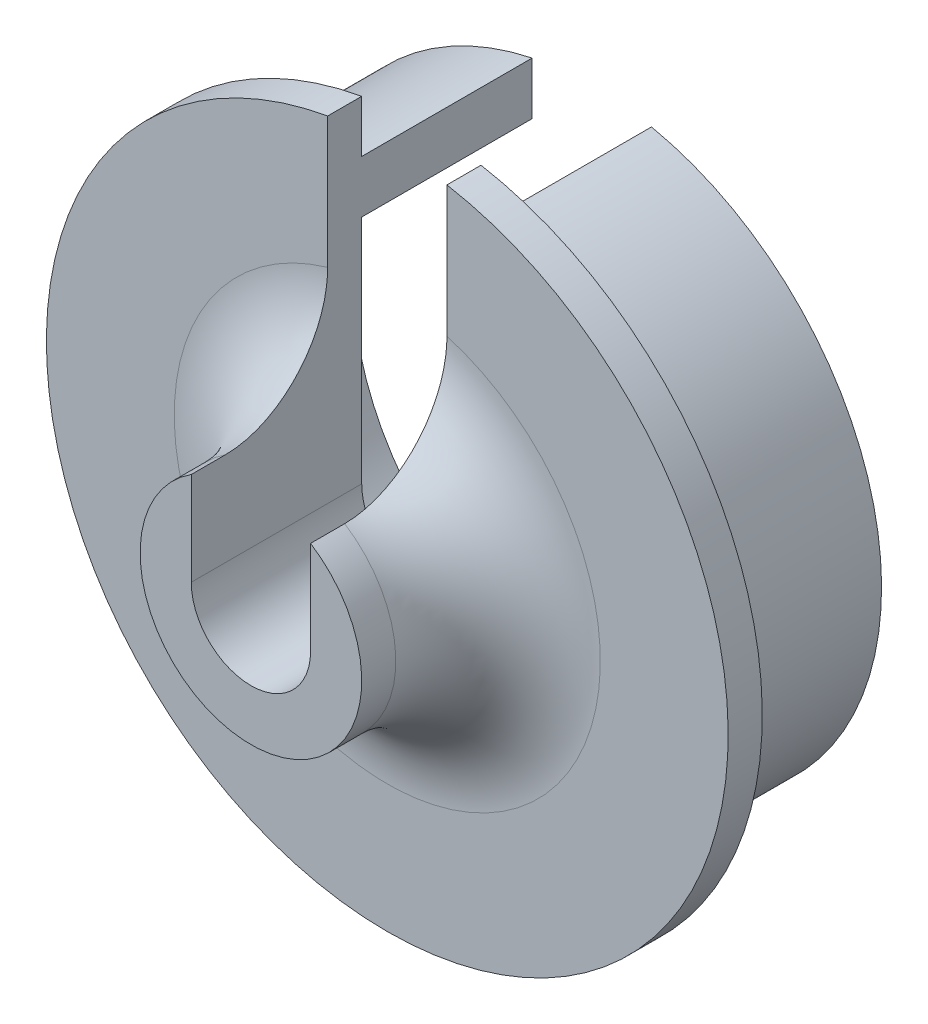
ISO-10303-21;
HEADER;
FILE_DESCRIPTION(('STEP AP214'),'2;1');
FILE_NAME('part.step','',(''),(''),'','','');
FILE_SCHEMA(('AUTOMOTIVE_DESIGN { 1 0 10303 214 1 1 1 1 }'));
ENDSEC;
DATA;
#1=APPLICATION_CONTEXT('core data for automotive mechanical design processes');
#2=APPLICATION_PROTOCOL_DEFINITION('international standard','automotive_design',2000,#1);
#3=PRODUCT_CONTEXT('',#1,'mechanical');
#4=PRODUCT('Part','Part','',(#3));
#5=PRODUCT_RELATED_PRODUCT_CATEGORY('part','',(#4));
#6=PRODUCT_DEFINITION_FORMATION('','',#4);
#7=PRODUCT_DEFINITION_CONTEXT('part definition',#1,'design');
#8=PRODUCT_DEFINITION('design','',#6,#7);
#9=PRODUCT_DEFINITION_SHAPE('','',#8);
#10=(LENGTH_UNIT() NAMED_UNIT(*) SI_UNIT(.MILLI.,.METRE.));
#11=(NAMED_UNIT(*) PLANE_ANGLE_UNIT() SI_UNIT($,.RADIAN.));
#12=(NAMED_UNIT(*) SI_UNIT($,.STERADIAN.) SOLID_ANGLE_UNIT());
#13=UNCERTAINTY_MEASURE_WITH_UNIT(LENGTH_MEASURE(1.E-05),#10,'distance_accuracy_value','');
#14=(GEOMETRIC_REPRESENTATION_CONTEXT(3) GLOBAL_UNCERTAINTY_ASSIGNED_CONTEXT((#13)) GLOBAL_UNIT_ASSIGNED_CONTEXT((#10,
#11,#12)) REPRESENTATION_CONTEXT('',''));
#15=CARTESIAN_POINT('',(0.,0.,0.));
#16=DIRECTION('',(0.,0.,1.));
#17=DIRECTION('',(1.,0.,0.));
#18=AXIS2_PLACEMENT_3D('',#15,#16,#17);
#19=CARTESIAN_POINT('',(0.,0.,0.));
#20=DIRECTION('',(0.,0.,1.));
#21=DIRECTION('',(1.,0.,0.));
#22=AXIS2_PLACEMENT_3D('',#19,#20,#21);
#23=CYLINDRICAL_SURFACE('',#22,1.75);
#24=DIRECTION('',(0.,0.,-1.));
#25=VECTOR('',#24,1.);
#26=CARTESIAN_POINT('',(-1.75,0.,0.));
#27=LINE('',#26,#25);
#28=CARTESIAN_POINT('',(-1.75,0.,0.));
#29=VERTEX_POINT('',#28);
#30=CARTESIAN_POINT('',(-1.75,0.,-5.));
#31=VERTEX_POINT('',#30);
#32=EDGE_CURVE('E114',#29,#31,#27,.T.);
#33=ORIENTED_EDGE('',*,*,#32,.F.);
#34=CARTESIAN_POINT('',(0.,0.,0.));
#35=DIRECTION('',(0.,0.,1.));
#36=DIRECTION('',(1.,0.,0.));
#37=AXIS2_PLACEMENT_3D('',#34,#35,#36);
#38=CIRCLE('',#37,1.75);
#39=CARTESIAN_POINT('',(1.75,0.,0.));
#40=VERTEX_POINT('',#39);
#41=EDGE_CURVE('E126',#29,#40,#38,.T.);
#42=ORIENTED_EDGE('',*,*,#41,.T.);
#43=DIRECTION('',(0.,0.,-1.));
#44=VECTOR('',#43,1.);
#45=CARTESIAN_POINT('',(1.75,0.,0.));
#46=LINE('',#45,#44);
#47=CARTESIAN_POINT('',(1.75,0.,-5.));
#48=VERTEX_POINT('',#47);
#49=EDGE_CURVE('E54',#40,#48,#46,.T.);
#50=ORIENTED_EDGE('',*,*,#49,.T.);
#51=CARTESIAN_POINT('',(0.,0.,-5.));
#52=DIRECTION('',(0.,0.,1.));
#53=DIRECTION('',(1.,0.,0.));
#54=AXIS2_PLACEMENT_3D('',#51,#52,#53);
#55=CIRCLE('',#54,1.75);
#56=EDGE_CURVE('E11',#31,#48,#55,.T.);
#57=ORIENTED_EDGE('',*,*,#56,.F.);
#58=EDGE_LOOP('',(#33,#42,#50,#57));
#59=FACE_BOUND('',#58,.T.);
#60=ADVANCED_FACE('F32',(#59),#23,.F.);
#61=CARTESIAN_POINT('',(0.,7.,-5.));
#62=DIRECTION('',(0.,0.,1.));
#63=DIRECTION('',(1.,0.,0.));
#64=AXIS2_PLACEMENT_3D('',#61,#62,#63);
#65=PLANE('',#64);
#66=CARTESIAN_POINT('',(0.,0.,-5.));
#67=DIRECTION('',(0.,0.,1.));
#68=DIRECTION('',(1.,0.,0.));
#69=AXIS2_PLACEMENT_3D('',#66,#67,#68);
#70=CIRCLE('',#69,7.);
#71=CARTESIAN_POINT('',(-1.75,6.77772085586298,-5.));
#72=VERTEX_POINT('',#71);
#73=CARTESIAN_POINT('',(1.75,6.77772085586298,-5.));
#74=VERTEX_POINT('',#73);
#75=EDGE_CURVE('E39',#72,#74,#70,.T.);
#76=ORIENTED_EDGE('',*,*,#75,.F.);
#77=DIRECTION('',(0.,-1.,0.));
#78=VECTOR('',#77,1.);
#79=CARTESIAN_POINT('',(-1.75,7.,-5.));
#80=LINE('',#79,#78);
#81=EDGE_CURVE('E131',#72,#31,#80,.T.);
#82=ORIENTED_EDGE('',*,*,#81,.T.);
#83=ORIENTED_EDGE('',*,*,#56,.T.);
#84=DIRECTION('',(0.,-1.,0.));
#85=VECTOR('',#84,1.);
#86=CARTESIAN_POINT('',(1.75,7.,-5.));
#87=LINE('',#86,#85);
#88=EDGE_CURVE('E169',#74,#48,#87,.T.);
#89=ORIENTED_EDGE('',*,*,#88,.F.);
#90=EDGE_LOOP('',(#76,#82,#83,#89));
#91=FACE_BOUND('',#90,.T.);
#92=ADVANCED_FACE('F168',(#91),#65,.F.);
#93=CARTESIAN_POINT('',(0.,0.,0.));
#94=DIRECTION('',(0.,0.,1.));
#95=DIRECTION('',(1.,0.,0.));
#96=AXIS2_PLACEMENT_3D('',#93,#94,#95);
#97=CYLINDRICAL_SURFACE('',#96,7.);
#98=CARTESIAN_POINT('',(0.,0.,-10.));
#99=DIRECTION('',(0.,0.,1.));
#100=DIRECTION('',(1.,0.,0.));
#101=AXIS2_PLACEMENT_3D('',#98,#99,#100);
#102=CIRCLE('',#101,7.);
#103=CARTESIAN_POINT('',(-1.75,6.77772085586298,-10.));
#104=VERTEX_POINT('',#103);
#105=CARTESIAN_POINT('',(1.75,6.77772085586298,-10.));
#106=VERTEX_POINT('',#105);
#107=EDGE_CURVE('E156',#104,#106,#102,.T.);
#108=ORIENTED_EDGE('',*,*,#107,.F.);
#109=DIRECTION('',(0.,0.,1.));
#110=VECTOR('',#109,1.);
#111=CARTESIAN_POINT('',(-1.75,6.77772085586298,0.));
#112=LINE('',#111,#110);
#113=EDGE_CURVE('E135',#104,#72,#112,.T.);
#114=ORIENTED_EDGE('',*,*,#113,.T.);
#115=ORIENTED_EDGE('',*,*,#75,.T.);
#116=DIRECTION('',(0.,0.,1.));
#117=VECTOR('',#116,1.);
#118=CARTESIAN_POINT('',(1.75,6.77772085586298,0.));
#119=LINE('',#118,#117);
#120=EDGE_CURVE('E165',#106,#74,#119,.T.);
#121=ORIENTED_EDGE('',*,*,#120,.F.);
#122=EDGE_LOOP('',(#108,#114,#115,#121));
#123=FACE_BOUND('',#122,.T.);
#124=ADVANCED_FACE('F164',(#123),#97,.F.);
#125=CARTESIAN_POINT('',(0.,8.5,-10.));
#126=DIRECTION('',(0.,0.,1.));
#127=DIRECTION('',(1.,0.,0.));
#128=AXIS2_PLACEMENT_3D('',#125,#126,#127);
#129=PLANE('',#128);
#130=CARTESIAN_POINT('',(0.,0.,-10.));
#131=DIRECTION('',(0.,0.,1.));
#132=DIRECTION('',(1.,0.,0.));
#133=AXIS2_PLACEMENT_3D('',#130,#131,#132);
#134=CIRCLE('',#133,8.5);
#135=CARTESIAN_POINT('',(-1.75,8.31790237980706,-10.));
#136=VERTEX_POINT('',#135);
#137=CARTESIAN_POINT('',(1.75,8.31790237980706,-10.));
#138=VERTEX_POINT('',#137);
#139=EDGE_CURVE('E153',#136,#138,#134,.T.);
#140=ORIENTED_EDGE('',*,*,#139,.F.);
#141=DIRECTION('',(0.,1.,0.));
#142=VECTOR('',#141,1.);
#143=CARTESIAN_POINT('',(-1.75,0.,-10.));
#144=LINE('',#143,#142);
#145=EDGE_CURVE('E259',#104,#136,#144,.T.);
#146=ORIENTED_EDGE('',*,*,#145,.F.);
#147=ORIENTED_EDGE('',*,*,#107,.T.);
#148=DIRECTION('',(0.,1.,0.));
#149=VECTOR('',#148,1.);
#150=CARTESIAN_POINT('',(1.75,0.,-10.));
#151=LINE('',#150,#149);
#152=EDGE_CURVE('E121',#106,#138,#151,.T.);
#153=ORIENTED_EDGE('',*,*,#152,.T.);
#154=EDGE_LOOP('',(#140,#146,#147,#153));
#155=FACE_BOUND('',#154,.T.);
#156=ADVANCED_FACE('F212',(#155),#129,.F.);
#157=CARTESIAN_POINT('',(0.,0.,0.));
#158=DIRECTION('',(0.,0.,1.));
#159=DIRECTION('',(1.,0.,0.));
#160=AXIS2_PLACEMENT_3D('',#157,#158,#159);
#161=CYLINDRICAL_SURFACE('',#160,8.5);
#162=CARTESIAN_POINT('',(0.,0.,-5.));
#163=DIRECTION('',(0.,0.,1.));
#164=DIRECTION('',(1.,0.,0.));
#165=AXIS2_PLACEMENT_3D('',#162,#163,#164);
#166=CIRCLE('',#165,8.5);
#167=CARTESIAN_POINT('',(-1.75,8.31790237980706,-5.));
#168=VERTEX_POINT('',#167);
#169=CARTESIAN_POINT('',(1.75,8.31790237980706,-5.));
#170=VERTEX_POINT('',#169);
#171=EDGE_CURVE('E150',#168,#170,#166,.T.);
#172=ORIENTED_EDGE('',*,*,#171,.F.);
#173=DIRECTION('',(0.,0.,1.));
#174=VECTOR('',#173,1.);
#175=CARTESIAN_POINT('',(-1.75,8.31790237980706,0.));
#176=LINE('',#175,#174);
#177=EDGE_CURVE('E262',#168,#136,#176,.F.);
#178=ORIENTED_EDGE('',*,*,#177,.T.);
#179=ORIENTED_EDGE('',*,*,#139,.T.);
#180=DIRECTION('',(0.,0.,1.));
#181=VECTOR('',#180,1.);
#182=CARTESIAN_POINT('',(1.75,8.31790237980706,0.));
#183=LINE('',#182,#181);
#184=EDGE_CURVE('E173',#170,#138,#183,.F.);
#185=ORIENTED_EDGE('',*,*,#184,.F.);
#186=EDGE_LOOP('',(#172,#178,#179,#185));
#187=FACE_BOUND('',#186,.T.);
#188=ADVANCED_FACE('F217',(#187),#161,.T.);
#189=CARTESIAN_POINT('',(0.,10.,-5.));
#190=DIRECTION('',(0.,0.,1.));
#191=DIRECTION('',(1.,0.,0.));
#192=AXIS2_PLACEMENT_3D('',#189,#190,#191);
#193=PLANE('',#192);
#194=CARTESIAN_POINT('',(0.,0.,-5.));
#195=DIRECTION('',(0.,0.,1.));
#196=DIRECTION('',(1.,0.,0.));
#197=AXIS2_PLACEMENT_3D('',#194,#195,#196);
#198=CIRCLE('',#197,10.);
#199=CARTESIAN_POINT('',(-1.75,9.84568433375761,-5.));
#200=VERTEX_POINT('',#199);
#201=CARTESIAN_POINT('',(1.75,9.84568433375761,-5.));
#202=VERTEX_POINT('',#201);
#203=EDGE_CURVE('E147',#200,#202,#198,.T.);
#204=ORIENTED_EDGE('',*,*,#203,.F.);
#205=DIRECTION('',(0.,-1.,0.));
#206=VECTOR('',#205,1.);
#207=CARTESIAN_POINT('',(-1.75,10.,-5.));
#208=LINE('',#207,#206);
#209=EDGE_CURVE('E264',#200,#168,#208,.T.);
#210=ORIENTED_EDGE('',*,*,#209,.T.);
#211=ORIENTED_EDGE('',*,*,#171,.T.);
#212=DIRECTION('',(0.,-1.,0.));
#213=VECTOR('',#212,1.);
#214=CARTESIAN_POINT('',(1.75,10.,-5.));
#215=LINE('',#214,#213);
#216=EDGE_CURVE('E252',#202,#170,#215,.T.);
#217=ORIENTED_EDGE('',*,*,#216,.F.);
#218=EDGE_LOOP('',(#204,#210,#211,#217));
#219=FACE_BOUND('',#218,.T.);
#220=ADVANCED_FACE('F221',(#219),#193,.F.);
#221=CARTESIAN_POINT('',(0.,0.,0.));
#222=DIRECTION('',(0.,0.,1.));
#223=DIRECTION('',(1.,0.,0.));
#224=AXIS2_PLACEMENT_3D('',#221,#222,#223);
#225=CYLINDRICAL_SURFACE('',#224,10.);
#226=CARTESIAN_POINT('',(0.,0.,-4.));
#227=DIRECTION('',(0.,0.,1.));
#228=DIRECTION('',(1.,0.,0.));
#229=AXIS2_PLACEMENT_3D('',#226,#227,#228);
#230=CIRCLE('',#229,10.);
#231=CARTESIAN_POINT('',(-1.75,9.84568433375761,-4.));
#232=VERTEX_POINT('',#231);
#233=CARTESIAN_POINT('',(1.75,9.84568433375761,-4.));
#234=VERTEX_POINT('',#233);
#235=EDGE_CURVE('E144',#232,#234,#230,.T.);
#236=ORIENTED_EDGE('',*,*,#235,.F.);
#237=DIRECTION('',(0.,0.,-1.));
#238=VECTOR('',#237,1.);
#239=CARTESIAN_POINT('',(-1.75,9.84568433375761,0.));
#240=LINE('',#239,#238);
#241=EDGE_CURVE('E245',#232,#200,#240,.T.);
#242=ORIENTED_EDGE('',*,*,#241,.T.);
#243=ORIENTED_EDGE('',*,*,#203,.T.);
#244=DIRECTION('',(0.,0.,-1.));
#245=VECTOR('',#244,1.);
#246=CARTESIAN_POINT('',(1.75,9.84568433375761,0.));
#247=LINE('',#246,#245);
#248=EDGE_CURVE('E269',#234,#202,#247,.T.);
#249=ORIENTED_EDGE('',*,*,#248,.F.);
#250=EDGE_LOOP('',(#236,#242,#243,#249));
#251=FACE_BOUND('',#250,.T.);
#252=ADVANCED_FACE('F225',(#251),#225,.T.);
#253=CARTESIAN_POINT('',(0.,6.25,-4.));
#254=DIRECTION('',(0.,0.,-1.));
#255=DIRECTION('',(-1.,0.,0.));
#256=AXIS2_PLACEMENT_3D('',#253,#254,#255);
#257=PLANE('',#256);
#258=CARTESIAN_POINT('',(0.,0.,-4.));
#259=DIRECTION('',(0.,0.,1.));
#260=DIRECTION('',(1.,0.,0.));
#261=AXIS2_PLACEMENT_3D('',#258,#259,#260);
#262=CIRCLE('',#261,6.25);
#263=CARTESIAN_POINT('',(-1.75,6.,-4.));
#264=VERTEX_POINT('',#263);
#265=CARTESIAN_POINT('',(1.75,6.,-4.));
#266=VERTEX_POINT('',#265);
#267=EDGE_CURVE('E141',#264,#266,#262,.T.);
#268=ORIENTED_EDGE('',*,*,#267,.F.);
#269=DIRECTION('',(0.,1.,0.));
#270=VECTOR('',#269,1.);
#271=CARTESIAN_POINT('',(-1.75,6.25,-4.));
#272=LINE('',#271,#270);
#273=EDGE_CURVE('E184',#264,#232,#272,.T.);
#274=ORIENTED_EDGE('',*,*,#273,.T.);
#275=ORIENTED_EDGE('',*,*,#235,.T.);
#276=DIRECTION('',(0.,1.,0.));
#277=VECTOR('',#276,1.);
#278=CARTESIAN_POINT('',(1.75,6.25,-4.));
#279=LINE('',#278,#277);
#280=EDGE_CURVE('E237',#266,#234,#279,.T.);
#281=ORIENTED_EDGE('',*,*,#280,.F.);
#282=EDGE_LOOP('',(#268,#274,#275,#281));
#283=FACE_BOUND('',#282,.T.);
#284=ADVANCED_FACE('F203',(#283),#257,.F.);
#285=CARTESIAN_POINT('',(0.,0.,-1.));
#286=DIRECTION('',(0.,0.,1.));
#287=DIRECTION('',(1.,0.,0.));
#288=AXIS2_PLACEMENT_3D('',#285,#286,#287);
#289=TOROIDAL_SURFACE('',#288,6.25,3.);
#290=CARTESIAN_POINT('',(0.,0.,-1.));
#291=DIRECTION('',(0.,0.,1.));
#292=DIRECTION('',(1.,0.,0.));
#293=AXIS2_PLACEMENT_3D('',#290,#291,#292);
#294=CIRCLE('',#293,3.25);
#295=CARTESIAN_POINT('',(-1.75,2.73861278752583,-1.));
#296=VERTEX_POINT('',#295);
#297=CARTESIAN_POINT('',(1.75,2.73861278752583,-1.));
#298=VERTEX_POINT('',#297);
#299=EDGE_CURVE('E133',#296,#298,#294,.T.);
#300=ORIENTED_EDGE('',*,*,#299,.F.);
#301=CARTESIAN_POINT('',(-1.75,3.22339233645491,-2.52716865001466));
#302=CARTESIAN_POINT('',(-1.75,3.32764063805838,-2.68207383004395));
#303=CARTESIAN_POINT('',(-1.75,3.44596473676776,-2.82777400252976));
#304=CARTESIAN_POINT('',(-1.75,3.7055927531595,-3.0974412583496));
#305=CARTESIAN_POINT('',(-1.75,3.84695964113905,-3.22134679680169));
#306=CARTESIAN_POINT('',(-1.75,4.14765305167195,-3.44404701957512));
#307=CARTESIAN_POINT('',(-1.75,4.30692759336561,-3.54291180506354));
#308=CARTESIAN_POINT('',(-1.75,4.63933086515907,-3.71331003646367));
#309=CARTESIAN_POINT('',(-1.75,4.81244947710999,-3.78486322660515));
#310=CARTESIAN_POINT('',(-1.75,5.17326739207167,-3.90009316433568));
#311=CARTESIAN_POINT('',(-1.75,5.36124250420018,-3.94291133786452));
#312=CARTESIAN_POINT('',(-1.75,5.74182484503164,-3.99537477010775));
#313=CARTESIAN_POINT('',(-1.75,5.93443240351347,-4.00501766002854));
#314=CARTESIAN_POINT('',(-1.75,6.31277892299027,-3.99028191352522));
#315=CARTESIAN_POINT('',(-1.75,6.49855537945409,-3.96687953648853));
#316=CARTESIAN_POINT('',(-1.75,6.86311863303392,-3.88781277332667));
#317=CARTESIAN_POINT('',(-1.75,7.04190722131198,-3.83215671327505));
#318=CARTESIAN_POINT('',(-1.75,7.37940270852504,-3.69275792447932));
#319=CARTESIAN_POINT('',(-1.75,7.53863766875506,-3.61029309989991));
#320=CARTESIAN_POINT('',(-1.75,7.84031992921684,-3.41889153054801));
#321=CARTESIAN_POINT('',(-1.75,7.98277062577496,-3.3099601550382));
#322=CARTESIAN_POINT('',(-1.75,8.24171148938125,-3.07282978334636));
#323=CARTESIAN_POINT('',(-1.75,8.35892417091532,-2.94541926199822));
#324=CARTESIAN_POINT('',(-1.75,8.5696843701568,-2.67233072840622));
#325=CARTESIAN_POINT('',(-1.75,8.66323515648966,-2.52665524342518));
#326=CARTESIAN_POINT('',(-1.75,8.82183123005936,-2.22481561343611));
#327=CARTESIAN_POINT('',(-1.75,8.88748241350266,-2.06896959814571));
#328=CARTESIAN_POINT('',(-1.75,8.99130409767623,-1.74837875231041));
#329=CARTESIAN_POINT('',(-1.75,9.02947689540727,-1.58363466681988));
#330=CARTESIAN_POINT('',(-1.75,9.07684408001065,-1.25218982189958));
#331=CARTESIAN_POINT('',(-1.75,9.08640289805354,-1.08554104704518));
#332=CARTESIAN_POINT('',(-1.75,9.07728702228691,-0.753020838716941));
#333=CARTESIAN_POINT('',(-1.75,9.05861333702801,-0.587149377687418));
#334=CARTESIAN_POINT('',(-1.75,8.99373288727866,-0.261555237651974));
#335=CARTESIAN_POINT('',(-1.75,8.94763278382643,-0.101811277278007));
#336=CARTESIAN_POINT('',(-1.75,8.829384423666,0.207718663767008));
#337=CARTESIAN_POINT('',(-1.75,8.7572360536307,0.357504601110749));
#338=CARTESIAN_POINT('',(-1.75,8.58866874006477,0.643640260734512));
#339=CARTESIAN_POINT('',(-1.75,8.49214143924159,0.779926110773294));
#340=CARTESIAN_POINT('',(-1.75,8.27785026166404,1.0346172141216));
#341=CARTESIAN_POINT('',(-1.75,8.16008544317213,1.15302167408674));
#342=CARTESIAN_POINT('',(-1.75,7.9050680479392,1.37032778696655));
#343=CARTESIAN_POINT('',(-1.75,7.76757928503792,1.46895210799431));
#344=CARTESIAN_POINT('',(-1.75,7.47829617937404,1.64230138196092));
#345=CARTESIAN_POINT('',(-1.75,7.32650063910051,1.71702433199468));
#346=CARTESIAN_POINT('',(-1.75,7.00928358306021,1.84234870028919));
#347=CARTESIAN_POINT('',(-1.75,6.84363136763473,1.89236565196628));
#348=CARTESIAN_POINT('',(-1.75,6.50641826789983,1.96483608644403));
#349=CARTESIAN_POINT('',(-1.75,6.33485656313793,1.98728572591083));
#350=CARTESIAN_POINT('',(-1.75,5.98471022181484,2.00485253292925));
#351=CARTESIAN_POINT('',(-1.75,5.80607968538388,1.99904986542327));
#352=CARTESIAN_POINT('',(-1.75,5.45209702273134,1.95875550219431));
#353=CARTESIAN_POINT('',(-1.75,5.27674551497505,1.92425844906342));
#354=CARTESIAN_POINT('',(-1.75,4.92673726751901,1.82604116673147));
#355=CARTESIAN_POINT('',(-1.75,4.75239708438547,1.7611925677948));
#356=CARTESIAN_POINT('',(-1.75,4.41649968968031,1.60411436118526));
#357=CARTESIAN_POINT('',(-1.75,4.25494605948631,1.51187711637631));
#358=CARTESIAN_POINT('',(-1.75,3.94370518370552,1.2989492470292));
#359=CARTESIAN_POINT('',(-1.75,3.79459834822274,1.17740739516421));
#360=CARTESIAN_POINT('',(-1.75,3.51921831599342,0.910569478867151));
#361=CARTESIAN_POINT('',(-1.75,3.39295709661959,0.765261029782408));
#362=CARTESIAN_POINT('',(-1.75,3.1709150345838,0.457062310017416));
#363=CARTESIAN_POINT('',(-1.75,3.07457302404685,0.294583700404541));
#364=CARTESIAN_POINT('',(-1.75,2.95510129266014,0.0394769837621704));
#365=CARTESIAN_POINT('',(-1.75,2.91945660566759,-0.0474340045086737));
#366=CARTESIAN_POINT('',(-1.75,2.8572093704441,-0.224463812577764));
#367=CARTESIAN_POINT('',(-1.75,2.83060485029954,-0.314581928067719));
#368=CARTESIAN_POINT('',(-1.75,2.78996603660335,-0.48528406461675));
#369=CARTESIAN_POINT('',(-1.75,2.77474876573539,-0.565588285610291));
#370=CARTESIAN_POINT('',(-1.75,2.75203605768233,-0.727278155061388));
#371=CARTESIAN_POINT('',(-1.75,2.74453943045313,-0.808663634896506));
#372=CARTESIAN_POINT('',(-1.75,2.73745508340288,-0.971762931691827));
#373=CARTESIAN_POINT('',(-1.75,2.73786542599521,-1.05347666330777));
#374=CARTESIAN_POINT('',(-1.75,2.7465683395797,-1.2164580899782));
#375=CARTESIAN_POINT('',(-1.75,2.75486030048191,-1.29772581906655));
#376=CARTESIAN_POINT('',(-1.75,2.78837884602897,-1.52038737925858));
#377=CARTESIAN_POINT('',(-1.75,2.82168001337595,-1.6606285326699));
#378=CARTESIAN_POINT('',(-1.75,2.90992503641957,-1.93387780582073));
#379=CARTESIAN_POINT('',(-1.75,2.96484831933423,-2.06689266465311));
#380=CARTESIAN_POINT('',(-1.75,3.05791096052255,-2.25244393845335));
#381=CARTESIAN_POINT('',(-1.75,3.08856707178245,-2.30885517587067));
#382=CARTESIAN_POINT('',(-1.75,3.1533926070783,-2.41959592034923));
#383=CARTESIAN_POINT('',(-1.75,3.18756103306028,-2.4739260127951));
#384=CARTESIAN_POINT('',(-1.75,3.22339233645491,-2.52716865001466));
#385=B_SPLINE_CURVE_WITH_KNOTS('',3,(#301,#302,#303,#304,#305,#306,#307,#308,#309,#310,#311,
#312,#313,#314,#315,#316,#317,#318,#319,#320,#321,#322,#323,#324,#325,#326,#327,#328,#329,#330,
#331,#332,#333,#334,#335,#336,#337,#338,#339,#340,#341,#342,#343,#344,#345,#346,#347,#348,#349,
#350,#351,#352,#353,#354,#355,#356,#357,#358,#359,#360,#361,#362,#363,#364,#365,#366,#367,#368,
#369,#370,#371,#372,#373,#374,#375,#376,#377,#378,#379,#380,#381,#382,#383,#384),.UNSPECIFIED.,
.T.,.F.,(4,2,2,2,2,2,2,2,2,2,2,2,2,2,2,2,2,2,2,2,2,2,2,2,2,2,2,2,2,2,2,2,2,2,2,2,2,2,2,2,2,4),
(0.,0.559904781245676,1.12136611926422,1.68123783631101,2.24070403814917,2.81621961694331,
3.3917762880565,3.95068060491528,4.50944070857215,5.04473140766287,5.57991360300176,
6.09675028247425,6.61351552771535,7.11840033731627,7.62324293717736,8.12162784732892,
8.61999495408105,9.11643647093951,9.61288014767111,10.1115704470848,10.6102828654159,
11.1155620651399,11.6208835955449,12.1376466046771,12.6544816508419,13.1882541331755,
13.722126296297,14.2776488653576,14.8333264837744,15.4076580416284,15.9822898398486,
16.5453823250222,16.8267905248669,17.1081373022372,17.3529853338515,17.5977956194437,
17.8425459155443,18.0872772678781,18.5176497241545,18.9476136800459,19.1401137451357,
19.3325592601257),.UNSPECIFIED.);
#386=EDGE_CURVE('E171',#296,#264,#385,.T.);
#387=ORIENTED_EDGE('',*,*,#386,.T.);
#388=ORIENTED_EDGE('',*,*,#267,.T.);
#389=CARTESIAN_POINT('',(1.75,3.22339233645491,-2.52716865001466));
#390=CARTESIAN_POINT('',(1.75,3.32764063805838,-2.68207383004395));
#391=CARTESIAN_POINT('',(1.75,3.44596473676776,-2.82777400252976));
#392=CARTESIAN_POINT('',(1.75,3.7055927531595,-3.0974412583496));
#393=CARTESIAN_POINT('',(1.75,3.84695964113905,-3.22134679680169));
#394=CARTESIAN_POINT('',(1.75,4.14765305167195,-3.44404701957512));
#395=CARTESIAN_POINT('',(1.75,4.30692759336561,-3.54291180506354));
#396=CARTESIAN_POINT('',(1.75,4.63933086515907,-3.71331003646367));
#397=CARTESIAN_POINT('',(1.75,4.81244947710999,-3.78486322660515));
#398=CARTESIAN_POINT('',(1.75,5.17326739207167,-3.90009316433568));
#399=CARTESIAN_POINT('',(1.75,5.36124250420018,-3.94291133786452));
#400=CARTESIAN_POINT('',(1.75,5.74182484503164,-3.99537477010775));
#401=CARTESIAN_POINT('',(1.75,5.93443240351347,-4.00501766002854));
#402=CARTESIAN_POINT('',(1.75,6.31277892299027,-3.99028191352522));
#403=CARTESIAN_POINT('',(1.75,6.49855537945409,-3.96687953648853));
#404=CARTESIAN_POINT('',(1.75,6.86311863303392,-3.88781277332667));
#405=CARTESIAN_POINT('',(1.75,7.04190722131198,-3.83215671327505));
#406=CARTESIAN_POINT('',(1.75,7.37940270852504,-3.69275792447932));
#407=CARTESIAN_POINT('',(1.75,7.53863766875506,-3.61029309989991));
#408=CARTESIAN_POINT('',(1.75,7.84031992921684,-3.41889153054801));
#409=CARTESIAN_POINT('',(1.75,7.98277062577496,-3.3099601550382));
#410=CARTESIAN_POINT('',(1.75,8.24171148938125,-3.07282978334636));
#411=CARTESIAN_POINT('',(1.75,8.35892417091532,-2.94541926199822));
#412=CARTESIAN_POINT('',(1.75,8.5696843701568,-2.67233072840622));
#413=CARTESIAN_POINT('',(1.75,8.66323515648966,-2.52665524342518));
#414=CARTESIAN_POINT('',(1.75,8.82183123005936,-2.22481561343611));
#415=CARTESIAN_POINT('',(1.75,8.88748241350266,-2.06896959814571));
#416=CARTESIAN_POINT('',(1.75,8.99130409767623,-1.74837875231041));
#417=CARTESIAN_POINT('',(1.75,9.02947689540727,-1.58363466681988));
#418=CARTESIAN_POINT('',(1.75,9.07684408001065,-1.25218982189958));
#419=CARTESIAN_POINT('',(1.75,9.08640289805354,-1.08554104704518));
#420=CARTESIAN_POINT('',(1.75,9.07728702228691,-0.753020838716941));
#421=CARTESIAN_POINT('',(1.75,9.05861333702801,-0.587149377687418));
#422=CARTESIAN_POINT('',(1.75,8.99373288727866,-0.261555237651974));
#423=CARTESIAN_POINT('',(1.75,8.94763278382643,-0.101811277278007));
#424=CARTESIAN_POINT('',(1.75,8.829384423666,0.207718663767008));
#425=CARTESIAN_POINT('',(1.75,8.7572360536307,0.357504601110749));
#426=CARTESIAN_POINT('',(1.75,8.58866874006477,0.643640260734512));
#427=CARTESIAN_POINT('',(1.75,8.49214143924159,0.779926110773294));
#428=CARTESIAN_POINT('',(1.75,8.27785026166404,1.0346172141216));
#429=CARTESIAN_POINT('',(1.75,8.16008544317213,1.15302167408674));
#430=CARTESIAN_POINT('',(1.75,7.9050680479392,1.37032778696655));
#431=CARTESIAN_POINT('',(1.75,7.76757928503792,1.46895210799431));
#432=CARTESIAN_POINT('',(1.75,7.47829617937404,1.64230138196092));
#433=CARTESIAN_POINT('',(1.75,7.32650063910051,1.71702433199468));
#434=CARTESIAN_POINT('',(1.75,7.00928358306021,1.84234870028919));
#435=CARTESIAN_POINT('',(1.75,6.84363136763473,1.89236565196628));
#436=CARTESIAN_POINT('',(1.75,6.50641826789983,1.96483608644403));
#437=CARTESIAN_POINT('',(1.75,6.33485656313793,1.98728572591083));
#438=CARTESIAN_POINT('',(1.75,5.98471022181484,2.00485253292925));
#439=CARTESIAN_POINT('',(1.75,5.80607968538388,1.99904986542327));
#440=CARTESIAN_POINT('',(1.75,5.45209702273134,1.95875550219431));
#441=CARTESIAN_POINT('',(1.75,5.27674551497505,1.92425844906342));
#442=CARTESIAN_POINT('',(1.75,4.92673726751901,1.82604116673147));
#443=CARTESIAN_POINT('',(1.75,4.75239708438547,1.7611925677948));
#444=CARTESIAN_POINT('',(1.75,4.41649968968031,1.60411436118526));
#445=CARTESIAN_POINT('',(1.75,4.25494605948631,1.51187711637631));
#446=CARTESIAN_POINT('',(1.75,3.94370518370552,1.2989492470292));
#447=CARTESIAN_POINT('',(1.75,3.79459834822274,1.17740739516421));
#448=CARTESIAN_POINT('',(1.75,3.51921831599342,0.910569478867151));
#449=CARTESIAN_POINT('',(1.75,3.39295709661959,0.765261029782408));
#450=CARTESIAN_POINT('',(1.75,3.1709150345838,0.457062310017416));
#451=CARTESIAN_POINT('',(1.75,3.07457302404685,0.294583700404541));
#452=CARTESIAN_POINT('',(1.75,2.95510129266014,0.0394769837621704));
#453=CARTESIAN_POINT('',(1.75,2.91945660566759,-0.0474340045086737));
#454=CARTESIAN_POINT('',(1.75,2.8572093704441,-0.224463812577764));
#455=CARTESIAN_POINT('',(1.75,2.83060485029954,-0.314581928067719));
#456=CARTESIAN_POINT('',(1.75,2.78996603660335,-0.48528406461675));
#457=CARTESIAN_POINT('',(1.75,2.77474876573539,-0.565588285610291));
#458=CARTESIAN_POINT('',(1.75,2.75203605768233,-0.727278155061388));
#459=CARTESIAN_POINT('',(1.75,2.74453943045313,-0.808663634896506));
#460=CARTESIAN_POINT('',(1.75,2.73745508340288,-0.971762931691827));
#461=CARTESIAN_POINT('',(1.75,2.73786542599521,-1.05347666330777));
#462=CARTESIAN_POINT('',(1.75,2.7465683395797,-1.2164580899782));
#463=CARTESIAN_POINT('',(1.75,2.75486030048191,-1.29772581906655));
#464=CARTESIAN_POINT('',(1.75,2.78837884602897,-1.52038737925858));
#465=CARTESIAN_POINT('',(1.75,2.82168001337595,-1.6606285326699));
#466=CARTESIAN_POINT('',(1.75,2.90992503641957,-1.93387780582073));
#467=CARTESIAN_POINT('',(1.75,2.96484831933423,-2.06689266465311));
#468=CARTESIAN_POINT('',(1.75,3.05791096052255,-2.25244393845335));
#469=CARTESIAN_POINT('',(1.75,3.08856707178245,-2.30885517587067));
#470=CARTESIAN_POINT('',(1.75,3.1533926070783,-2.41959592034923));
#471=CARTESIAN_POINT('',(1.75,3.18756103306028,-2.4739260127951));
#472=CARTESIAN_POINT('',(1.75,3.22339233645491,-2.52716865001466));
#473=B_SPLINE_CURVE_WITH_KNOTS('',3,(#389,#390,#391,#392,#393,#394,#395,#396,#397,#398,#399,
#400,#401,#402,#403,#404,#405,#406,#407,#408,#409,#410,#411,#412,#413,#414,#415,#416,#417,#418,
#419,#420,#421,#422,#423,#424,#425,#426,#427,#428,#429,#430,#431,#432,#433,#434,#435,#436,#437,
#438,#439,#440,#441,#442,#443,#444,#445,#446,#447,#448,#449,#450,#451,#452,#453,#454,#455,#456,
#457,#458,#459,#460,#461,#462,#463,#464,#465,#466,#467,#468,#469,#470,#471,#472),.UNSPECIFIED.,
.T.,.F.,(4,2,2,2,2,2,2,2,2,2,2,2,2,2,2,2,2,2,2,2,2,2,2,2,2,2,2,2,2,2,2,2,2,2,2,2,2,2,2,2,2,4),
(0.,0.559904781245676,1.12136611926422,1.68123783631101,2.24070403814917,2.81621961694331,
3.3917762880565,3.95068060491528,4.50944070857215,5.04473140766287,5.57991360300176,
6.09675028247425,6.61351552771535,7.11840033731627,7.62324293717736,8.12162784732892,
8.61999495408105,9.11643647093951,9.61288014767111,10.1115704470848,10.6102828654159,
11.1155620651399,11.6208835955449,12.1376466046771,12.6544816508419,13.1882541331755,
13.722126296297,14.2776488653576,14.8333264837744,15.4076580416284,15.9822898398486,
16.5453823250222,16.8267905248669,17.1081373022372,17.3529853338515,17.5977956194437,
17.8425459155443,18.0872772678781,18.5176497241545,18.9476136800459,19.1401137451357,
19.3325592601257),.UNSPECIFIED.);
#474=EDGE_CURVE('E240',#298,#266,#473,.T.);
#475=ORIENTED_EDGE('',*,*,#474,.F.);
#476=EDGE_LOOP('',(#300,#387,#388,#475));
#477=FACE_BOUND('',#476,.T.);
#478=ADVANCED_FACE('F186',(#477),#289,.F.);
#479=CARTESIAN_POINT('',(0.,0.,0.));
#480=DIRECTION('',(0.,0.,1.));
#481=DIRECTION('',(1.,0.,0.));
#482=AXIS2_PLACEMENT_3D('',#479,#480,#481);
#483=CYLINDRICAL_SURFACE('',#482,3.25);
#484=CARTESIAN_POINT('',(0.,0.,0.));
#485=DIRECTION('',(0.,0.,1.));
#486=DIRECTION('',(1.,0.,0.));
#487=AXIS2_PLACEMENT_3D('',#484,#485,#486);
#488=CIRCLE('',#487,3.25);
#489=CARTESIAN_POINT('',(-1.75,2.73861278752583,0.));
#490=VERTEX_POINT('',#489);
#491=CARTESIAN_POINT('',(1.75,2.73861278752583,0.));
#492=VERTEX_POINT('',#491);
#493=EDGE_CURVE('E130',#490,#492,#488,.T.);
#494=ORIENTED_EDGE('',*,*,#493,.F.);
#495=DIRECTION('',(0.,0.,1.));
#496=VECTOR('',#495,1.);
#497=CARTESIAN_POINT('',(-1.75,2.73861278752583,0.));
#498=LINE('',#497,#496);
#499=EDGE_CURVE('E46',#490,#296,#498,.F.);
#500=ORIENTED_EDGE('',*,*,#499,.T.);
#501=ORIENTED_EDGE('',*,*,#299,.T.);
#502=DIRECTION('',(0.,0.,1.));
#503=VECTOR('',#502,1.);
#504=CARTESIAN_POINT('',(1.75,2.73861278752583,0.));
#505=LINE('',#504,#503);
#506=EDGE_CURVE('E127',#492,#298,#505,.F.);
#507=ORIENTED_EDGE('',*,*,#506,.F.);
#508=EDGE_LOOP('',(#494,#500,#501,#507));
#509=FACE_BOUND('',#508,.T.);
#510=ADVANCED_FACE('F197',(#509),#483,.T.);
#511=CARTESIAN_POINT('',(0.,1.75,0.));
#512=DIRECTION('',(0.,0.,-1.));
#513=DIRECTION('',(-1.,0.,0.));
#514=AXIS2_PLACEMENT_3D('',#511,#512,#513);
#515=PLANE('',#514);
#516=ORIENTED_EDGE('',*,*,#41,.F.);
#517=DIRECTION('',(0.,1.,0.));
#518=VECTOR('',#517,1.);
#519=CARTESIAN_POINT('',(-1.75,0.,0.));
#520=LINE('',#519,#518);
#521=EDGE_CURVE('E111',#29,#490,#520,.T.);
#522=ORIENTED_EDGE('',*,*,#521,.T.);
#523=ORIENTED_EDGE('',*,*,#493,.T.);
#524=DIRECTION('',(0.,1.,0.));
#525=VECTOR('',#524,1.);
#526=CARTESIAN_POINT('',(1.75,0.,0.));
#527=LINE('',#526,#525);
#528=EDGE_CURVE('E120',#40,#492,#527,.T.);
#529=ORIENTED_EDGE('',*,*,#528,.F.);
#530=EDGE_LOOP('',(#516,#522,#523,#529));
#531=FACE_BOUND('',#530,.T.);
#532=ADVANCED_FACE('F129',(#531),#515,.F.);
#533=CARTESIAN_POINT('',(1.75,0.,0.));
#534=DIRECTION('',(-1.,0.,0.));
#535=DIRECTION('',(0.,0.,1.));
#536=AXIS2_PLACEMENT_3D('',#533,#534,#535);
#537=PLANE('',#536);
#538=ORIENTED_EDGE('',*,*,#88,.T.);
#539=ORIENTED_EDGE('',*,*,#49,.F.);
#540=ORIENTED_EDGE('',*,*,#528,.T.);
#541=ORIENTED_EDGE('',*,*,#506,.T.);
#542=ORIENTED_EDGE('',*,*,#474,.T.);
#543=ORIENTED_EDGE('',*,*,#280,.T.);
#544=ORIENTED_EDGE('',*,*,#248,.T.);
#545=ORIENTED_EDGE('',*,*,#216,.T.);
#546=ORIENTED_EDGE('',*,*,#184,.T.);
#547=ORIENTED_EDGE('',*,*,#152,.F.);
#548=ORIENTED_EDGE('',*,*,#120,.T.);
#549=EDGE_LOOP('',(#538,#539,#540,#541,#542,#543,#544,#545,#546,#547,#548));
#550=FACE_BOUND('',#549,.T.);
#551=ADVANCED_FACE('F194',(#550),#537,.T.);
#552=CARTESIAN_POINT('',(-1.75,0.,0.));
#553=DIRECTION('',(-1.,0.,0.));
#554=DIRECTION('',(0.,0.,1.));
#555=AXIS2_PLACEMENT_3D('',#552,#553,#554);
#556=PLANE('',#555);
#557=ORIENTED_EDGE('',*,*,#113,.F.);
#558=ORIENTED_EDGE('',*,*,#145,.T.);
#559=ORIENTED_EDGE('',*,*,#177,.F.);
#560=ORIENTED_EDGE('',*,*,#209,.F.);
#561=ORIENTED_EDGE('',*,*,#241,.F.);
#562=ORIENTED_EDGE('',*,*,#273,.F.);
#563=ORIENTED_EDGE('',*,*,#386,.F.);
#564=ORIENTED_EDGE('',*,*,#499,.F.);
#565=ORIENTED_EDGE('',*,*,#521,.F.);
#566=ORIENTED_EDGE('',*,*,#32,.T.);
#567=ORIENTED_EDGE('',*,*,#81,.F.);
#568=EDGE_LOOP('',(#557,#558,#559,#560,#561,#562,#563,#564,#565,#566,#567));
#569=FACE_BOUND('',#568,.T.);
#570=ADVANCED_FACE('F113',(#569),#556,.F.);
#571=CLOSED_SHELL('',(#60,#92,#124,#156,#188,#220,#252,#284,#478,#510,#532,#551,#570));
#572=MANIFOLD_SOLID_BREP('B2',#571);
#573=ADVANCED_BREP_SHAPE_REPRESENTATION('',(#18,#572),#14);
#574=SHAPE_DEFINITION_REPRESENTATION(#9,#573);
ENDSEC;
END-ISO-10303-21;
